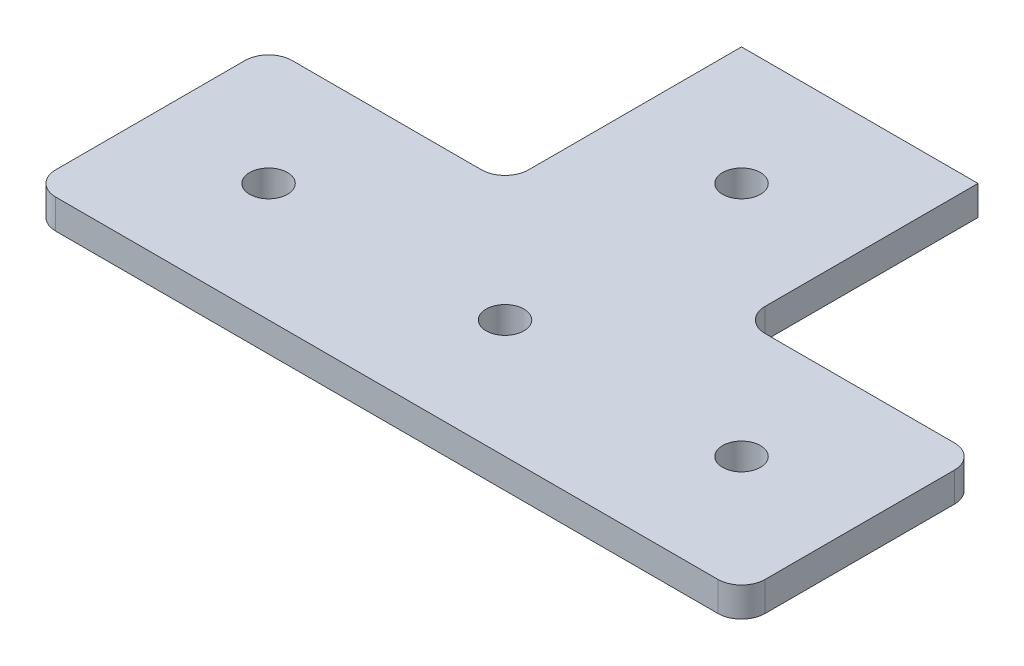
ISO-10303-21;
HEADER;
FILE_DESCRIPTION(('STEP AP214'),'2;1');
FILE_NAME('part.step','',(''),(''),'','','');
FILE_SCHEMA(('AUTOMOTIVE_DESIGN { 1 0 10303 214 1 1 1 1 }'));
ENDSEC;
DATA;
#1=APPLICATION_CONTEXT('core data for automotive mechanical design processes');
#2=APPLICATION_PROTOCOL_DEFINITION('international standard','automotive_design',2000,#1);
#3=PRODUCT_CONTEXT('',#1,'mechanical');
#4=PRODUCT('Part','Part','',(#3));
#5=PRODUCT_RELATED_PRODUCT_CATEGORY('part','',(#4));
#6=PRODUCT_DEFINITION_FORMATION('','',#4);
#7=PRODUCT_DEFINITION_CONTEXT('part definition',#1,'design');
#8=PRODUCT_DEFINITION('design','',#6,#7);
#9=PRODUCT_DEFINITION_SHAPE('','',#8);
#10=(LENGTH_UNIT() NAMED_UNIT(*) SI_UNIT(.MILLI.,.METRE.));
#11=(NAMED_UNIT(*) PLANE_ANGLE_UNIT() SI_UNIT($,.RADIAN.));
#12=(NAMED_UNIT(*) SI_UNIT($,.STERADIAN.) SOLID_ANGLE_UNIT());
#13=UNCERTAINTY_MEASURE_WITH_UNIT(LENGTH_MEASURE(1.E-05),#10,'distance_accuracy_value','');
#14=(GEOMETRIC_REPRESENTATION_CONTEXT(3) GLOBAL_UNCERTAINTY_ASSIGNED_CONTEXT((#13)) GLOBAL_UNIT_ASSIGNED_CONTEXT((#10,
#11,#12)) REPRESENTATION_CONTEXT('',''));
#15=CARTESIAN_POINT('',(0.,0.,0.));
#16=DIRECTION('',(0.,0.,1.));
#17=DIRECTION('',(1.,0.,0.));
#18=AXIS2_PLACEMENT_3D('',#15,#16,#17);
#19=CARTESIAN_POINT('',(-11.7594560669456,3.175,-20.0357112970711));
#20=DIRECTION('',(0.,1.,0.));
#21=DIRECTION('',(0.,0.,1.));
#22=AXIS2_PLACEMENT_3D('',#19,#20,#21);
#23=PLANE('',#22);
#24=CARTESIAN_POINT('',(28.8805439330544,3.175,-4.79571129707114));
#25=DIRECTION('',(0.,1.,0.));
#26=DIRECTION('',(0.,0.,1.));
#27=AXIS2_PLACEMENT_3D('',#24,#25,#26);
#28=CIRCLE('',#27,2.032);
#29=CARTESIAN_POINT('',(28.8805439330544,3.175,-2.76371129707114));
#30=VERTEX_POINT('',#29);
#31=EDGE_CURVE('E318',#30,#30,#28,.T.);
#32=ORIENTED_EDGE('',*,*,#31,.F.);
#33=EDGE_LOOP('',(#32));
#34=FACE_BOUND('',#33,.T.);
#35=CARTESIAN_POINT('',(3.48054393305439,3.175,-4.79571129707114));
#36=DIRECTION('',(0.,1.,0.));
#37=DIRECTION('',(0.,0.,1.));
#38=AXIS2_PLACEMENT_3D('',#35,#36,#37);
#39=CIRCLE('',#38,2.032);
#40=CARTESIAN_POINT('',(3.48054393305439,3.175,-2.76371129707114));
#41=VERTEX_POINT('',#40);
#42=EDGE_CURVE('E171',#41,#41,#39,.T.);
#43=ORIENTED_EDGE('',*,*,#42,.F.);
#44=EDGE_LOOP('',(#43));
#45=FACE_BOUND('',#44,.T.);
#46=CARTESIAN_POINT('',(-11.7594560669456,3.175,-20.0357112970711));
#47=DIRECTION('',(0.,-1.,0.));
#48=DIRECTION('',(0.,0.,1.));
#49=AXIS2_PLACEMENT_3D('',#46,#47,#48);
#50=CIRCLE('',#49,2.54);
#51=CARTESIAN_POINT('',(-9.21945606694562,3.175,-20.0357112970712));
#52=VERTEX_POINT('',#51);
#53=CARTESIAN_POINT('',(-11.7594560669456,3.175,-17.4957112970711));
#54=VERTEX_POINT('',#53);
#55=EDGE_CURVE('E194',#52,#54,#50,.T.);
#56=ORIENTED_EDGE('',*,*,#55,.T.);
#57=DIRECTION('',(-1.,0.,0.));
#58=VECTOR('',#57,1.);
#59=CARTESIAN_POINT('',(-32.0794560669456,3.175,-17.4957112970711));
#60=LINE('',#59,#58);
#61=CARTESIAN_POINT('',(-32.0794560669456,3.175,-17.4957112970711));
#62=VERTEX_POINT('',#61);
#63=EDGE_CURVE('E112',#54,#62,#60,.T.);
#64=ORIENTED_EDGE('',*,*,#63,.T.);
#65=CARTESIAN_POINT('',(-32.0794560669456,3.175,-14.9557112970711));
#66=DIRECTION('',(0.,1.,0.));
#67=DIRECTION('',(0.,0.,-1.));
#68=AXIS2_PLACEMENT_3D('',#65,#66,#67);
#69=CIRCLE('',#68,2.54);
#70=CARTESIAN_POINT('',(-34.6194560669456,3.175,-14.9557112970711));
#71=VERTEX_POINT('',#70);
#72=EDGE_CURVE('E227',#62,#71,#69,.T.);
#73=ORIENTED_EDGE('',*,*,#72,.T.);
#74=DIRECTION('',(0.,0.,1.));
#75=VECTOR('',#74,1.);
#76=CARTESIAN_POINT('',(-34.6194560669456,3.175,-14.9557112970711));
#77=LINE('',#76,#75);
#78=CARTESIAN_POINT('',(-34.6194560669456,3.175,5.36428870292885));
#79=VERTEX_POINT('',#78);
#80=EDGE_CURVE('E246',#71,#79,#77,.T.);
#81=ORIENTED_EDGE('',*,*,#80,.T.);
#82=CARTESIAN_POINT('',(-32.0794560669456,3.175,5.36428870292887));
#83=DIRECTION('',(0.,1.,0.));
#84=DIRECTION('',(0.,0.,-1.));
#85=AXIS2_PLACEMENT_3D('',#82,#83,#84);
#86=CIRCLE('',#85,2.54);
#87=CARTESIAN_POINT('',(-32.0794560669456,3.175,7.90428870292886));
#88=VERTEX_POINT('',#87);
#89=EDGE_CURVE('E243',#79,#88,#86,.T.);
#90=ORIENTED_EDGE('',*,*,#89,.T.);
#91=DIRECTION('',(1.,0.,0.));
#92=VECTOR('',#91,1.);
#93=CARTESIAN_POINT('',(-32.0794560669456,3.175,7.90428870292886));
#94=LINE('',#93,#92);
#95=CARTESIAN_POINT('',(39.0405439330544,3.175,7.90428870292886));
#96=VERTEX_POINT('',#95);
#97=EDGE_CURVE('E245',#88,#96,#94,.T.);
#98=ORIENTED_EDGE('',*,*,#97,.T.);
#99=CARTESIAN_POINT('',(39.0405439330544,3.175,5.36428870292886));
#100=DIRECTION('',(0.,1.,0.));
#101=DIRECTION('',(0.,0.,-1.));
#102=AXIS2_PLACEMENT_3D('',#99,#100,#101);
#103=CIRCLE('',#102,2.54);
#104=CARTESIAN_POINT('',(41.5805439330544,3.175,5.36428870292885));
#105=VERTEX_POINT('',#104);
#106=EDGE_CURVE('E248',#96,#105,#103,.T.);
#107=ORIENTED_EDGE('',*,*,#106,.T.);
#108=DIRECTION('',(0.,0.,-1.));
#109=VECTOR('',#108,1.);
#110=CARTESIAN_POINT('',(41.5805439330544,3.175,-14.9557112970711));
#111=LINE('',#110,#109);
#112=CARTESIAN_POINT('',(41.5805439330544,3.175,-14.9557112970711));
#113=VERTEX_POINT('',#112);
#114=EDGE_CURVE('E254',#105,#113,#111,.T.);
#115=ORIENTED_EDGE('',*,*,#114,.T.);
#116=CARTESIAN_POINT('',(39.0405439330544,3.175,-14.9557112970711));
#117=DIRECTION('',(0.,1.,0.));
#118=DIRECTION('',(0.,0.,-1.));
#119=AXIS2_PLACEMENT_3D('',#116,#117,#118);
#120=CIRCLE('',#119,2.54);
#121=CARTESIAN_POINT('',(39.0405439330544,3.175,-17.4957112970711));
#122=VERTEX_POINT('',#121);
#123=EDGE_CURVE('E256',#113,#122,#120,.T.);
#124=ORIENTED_EDGE('',*,*,#123,.T.);
#125=DIRECTION('',(-1.,0.,0.));
#126=VECTOR('',#125,1.);
#127=CARTESIAN_POINT('',(18.7205439330544,3.175,-17.4957112970711));
#128=LINE('',#127,#126);
#129=CARTESIAN_POINT('',(18.7205439330544,3.175,-17.4957112970711));
#130=VERTEX_POINT('',#129);
#131=EDGE_CURVE('E258',#122,#130,#128,.T.);
#132=ORIENTED_EDGE('',*,*,#131,.T.);
#133=CARTESIAN_POINT('',(18.7205439330544,3.175,-20.0357112970711));
#134=DIRECTION('',(0.,-1.,0.));
#135=DIRECTION('',(0.,0.,1.));
#136=AXIS2_PLACEMENT_3D('',#133,#134,#135);
#137=CIRCLE('',#136,2.54);
#138=CARTESIAN_POINT('',(16.1805439330544,3.175,-20.0357112970712));
#139=VERTEX_POINT('',#138);
#140=EDGE_CURVE('E149',#130,#139,#137,.T.);
#141=ORIENTED_EDGE('',*,*,#140,.T.);
#142=DIRECTION('',(0.,0.,-1.));
#143=VECTOR('',#142,1.);
#144=CARTESIAN_POINT('',(16.1805439330544,3.175,-20.0357112970712));
#145=LINE('',#144,#143);
#146=CARTESIAN_POINT('',(16.1805439330544,3.175,-42.8957112970711));
#147=VERTEX_POINT('',#146);
#148=EDGE_CURVE('E143',#139,#147,#145,.T.);
#149=ORIENTED_EDGE('',*,*,#148,.T.);
#150=DIRECTION('',(-1.,0.,0.));
#151=VECTOR('',#150,1.);
#152=CARTESIAN_POINT('',(-9.21945606694562,3.175,-42.8957112970711));
#153=LINE('',#152,#151);
#154=CARTESIAN_POINT('',(-9.21945606694562,3.175,-42.8957112970711));
#155=VERTEX_POINT('',#154);
#156=EDGE_CURVE('E147',#147,#155,#153,.T.);
#157=ORIENTED_EDGE('',*,*,#156,.T.);
#158=DIRECTION('',(0.,0.,1.));
#159=VECTOR('',#158,1.);
#160=CARTESIAN_POINT('',(-9.21945606694562,3.175,-20.0357112970712));
#161=LINE('',#160,#159);
#162=EDGE_CURVE('E51',#155,#52,#161,.T.);
#163=ORIENTED_EDGE('',*,*,#162,.T.);
#164=EDGE_LOOP('',(#56,#64,#73,#81,#90,#98,#107,#115,#124,#132,#141,#149,#157,#163));
#165=FACE_BOUND('',#164,.T.);
#166=CARTESIAN_POINT('',(-21.9194560669456,3.175,-4.79571129707114));
#167=DIRECTION('',(0.,1.,0.));
#168=DIRECTION('',(0.,0.,1.));
#169=AXIS2_PLACEMENT_3D('',#166,#167,#168);
#170=CIRCLE('',#169,2.032);
#171=CARTESIAN_POINT('',(-21.9194560669456,3.175,-2.76371129707114));
#172=VERTEX_POINT('',#171);
#173=EDGE_CURVE('E324',#172,#172,#170,.T.);
#174=ORIENTED_EDGE('',*,*,#173,.F.);
#175=EDGE_LOOP('',(#174));
#176=FACE_BOUND('',#175,.T.);
#177=CARTESIAN_POINT('',(3.48054393305439,3.175,-30.1957112970711));
#178=DIRECTION('',(0.,1.,0.));
#179=DIRECTION('',(0.,0.,1.));
#180=AXIS2_PLACEMENT_3D('',#177,#178,#179);
#181=CIRCLE('',#180,2.032);
#182=CARTESIAN_POINT('',(3.48054393305439,3.175,-28.1637112970711));
#183=VERTEX_POINT('',#182);
#184=EDGE_CURVE('E309',#183,#183,#181,.T.);
#185=ORIENTED_EDGE('',*,*,#184,.F.);
#186=EDGE_LOOP('',(#185));
#187=FACE_BOUND('',#186,.T.);
#188=ADVANCED_FACE('F34',(#34,#45,#165,#176,#187),#23,.T.);
#189=CARTESIAN_POINT('',(-11.7594560669456,0.,-20.0357112970711));
#190=DIRECTION('',(0.,1.,0.));
#191=DIRECTION('',(0.,0.,1.));
#192=AXIS2_PLACEMENT_3D('',#189,#190,#191);
#193=PLANE('',#192);
#194=CARTESIAN_POINT('',(-11.7594560669456,0.,-20.0357112970711));
#195=DIRECTION('',(0.,-1.,0.));
#196=DIRECTION('',(0.,0.,1.));
#197=AXIS2_PLACEMENT_3D('',#194,#195,#196);
#198=CIRCLE('',#197,2.54);
#199=CARTESIAN_POINT('',(-9.21945606694562,0.,-20.0357112970712));
#200=VERTEX_POINT('',#199);
#201=CARTESIAN_POINT('',(-11.7594560669456,0.,-17.4957112970711));
#202=VERTEX_POINT('',#201);
#203=EDGE_CURVE('E167',#200,#202,#198,.T.);
#204=ORIENTED_EDGE('',*,*,#203,.F.);
#205=DIRECTION('',(0.,0.,1.));
#206=VECTOR('',#205,1.);
#207=CARTESIAN_POINT('',(-9.21945606694562,0.,-20.0357112970712));
#208=LINE('',#207,#206);
#209=CARTESIAN_POINT('',(-9.21945606694562,0.,-42.8957112970711));
#210=VERTEX_POINT('',#209);
#211=EDGE_CURVE('E104',#210,#200,#208,.T.);
#212=ORIENTED_EDGE('',*,*,#211,.F.);
#213=DIRECTION('',(-1.,0.,0.));
#214=VECTOR('',#213,1.);
#215=CARTESIAN_POINT('',(-9.21945606694562,0.,-42.8957112970711));
#216=LINE('',#215,#214);
#217=CARTESIAN_POINT('',(16.1805439330544,0.,-42.8957112970711));
#218=VERTEX_POINT('',#217);
#219=EDGE_CURVE('E98',#218,#210,#216,.T.);
#220=ORIENTED_EDGE('',*,*,#219,.F.);
#221=DIRECTION('',(0.,0.,-1.));
#222=VECTOR('',#221,1.);
#223=CARTESIAN_POINT('',(16.1805439330544,0.,-20.0357112970712));
#224=LINE('',#223,#222);
#225=CARTESIAN_POINT('',(16.1805439330544,0.,-20.0357112970712));
#226=VERTEX_POINT('',#225);
#227=EDGE_CURVE('E157',#226,#218,#224,.T.);
#228=ORIENTED_EDGE('',*,*,#227,.F.);
#229=CARTESIAN_POINT('',(18.7205439330544,0.,-20.0357112970711));
#230=DIRECTION('',(0.,-1.,0.));
#231=DIRECTION('',(0.,0.,1.));
#232=AXIS2_PLACEMENT_3D('',#229,#230,#231);
#233=CIRCLE('',#232,2.54);
#234=CARTESIAN_POINT('',(18.7205439330544,0.,-17.4957112970711));
#235=VERTEX_POINT('',#234);
#236=EDGE_CURVE('E189',#235,#226,#233,.T.);
#237=ORIENTED_EDGE('',*,*,#236,.F.);
#238=DIRECTION('',(-1.,0.,0.));
#239=VECTOR('',#238,1.);
#240=CARTESIAN_POINT('',(18.7205439330544,0.,-17.4957112970711));
#241=LINE('',#240,#239);
#242=CARTESIAN_POINT('',(39.0405439330544,0.,-17.4957112970711));
#243=VERTEX_POINT('',#242);
#244=EDGE_CURVE('E187',#243,#235,#241,.T.);
#245=ORIENTED_EDGE('',*,*,#244,.F.);
#246=CARTESIAN_POINT('',(39.0405439330544,0.,-14.9557112970711));
#247=DIRECTION('',(0.,1.,0.));
#248=DIRECTION('',(0.,0.,-1.));
#249=AXIS2_PLACEMENT_3D('',#246,#247,#248);
#250=CIRCLE('',#249,2.54);
#251=CARTESIAN_POINT('',(41.5805439330544,0.,-14.9557112970711));
#252=VERTEX_POINT('',#251);
#253=EDGE_CURVE('E185',#252,#243,#250,.T.);
#254=ORIENTED_EDGE('',*,*,#253,.F.);
#255=DIRECTION('',(0.,0.,-1.));
#256=VECTOR('',#255,1.);
#257=CARTESIAN_POINT('',(41.5805439330544,0.,-14.9557112970711));
#258=LINE('',#257,#256);
#259=CARTESIAN_POINT('',(41.5805439330544,0.,5.36428870292885));
#260=VERTEX_POINT('',#259);
#261=EDGE_CURVE('E183',#260,#252,#258,.T.);
#262=ORIENTED_EDGE('',*,*,#261,.F.);
#263=CARTESIAN_POINT('',(39.0405439330544,0.,5.36428870292886));
#264=DIRECTION('',(0.,1.,0.));
#265=DIRECTION('',(0.,0.,-1.));
#266=AXIS2_PLACEMENT_3D('',#263,#264,#265);
#267=CIRCLE('',#266,2.54);
#268=CARTESIAN_POINT('',(39.0405439330544,0.,7.90428870292886));
#269=VERTEX_POINT('',#268);
#270=EDGE_CURVE('E181',#269,#260,#267,.T.);
#271=ORIENTED_EDGE('',*,*,#270,.F.);
#272=DIRECTION('',(1.,0.,0.));
#273=VECTOR('',#272,1.);
#274=CARTESIAN_POINT('',(-32.0794560669456,0.,7.90428870292886));
#275=LINE('',#274,#273);
#276=CARTESIAN_POINT('',(-32.0794560669456,0.,7.90428870292886));
#277=VERTEX_POINT('',#276);
#278=EDGE_CURVE('E179',#277,#269,#275,.T.);
#279=ORIENTED_EDGE('',*,*,#278,.F.);
#280=CARTESIAN_POINT('',(-32.0794560669456,0.,5.36428870292887));
#281=DIRECTION('',(0.,1.,0.));
#282=DIRECTION('',(0.,0.,-1.));
#283=AXIS2_PLACEMENT_3D('',#280,#281,#282);
#284=CIRCLE('',#283,2.54);
#285=CARTESIAN_POINT('',(-34.6194560669456,0.,5.36428870292885));
#286=VERTEX_POINT('',#285);
#287=EDGE_CURVE('E177',#286,#277,#284,.T.);
#288=ORIENTED_EDGE('',*,*,#287,.F.);
#289=DIRECTION('',(0.,0.,1.));
#290=VECTOR('',#289,1.);
#291=CARTESIAN_POINT('',(-34.6194560669456,0.,-14.9557112970711));
#292=LINE('',#291,#290);
#293=CARTESIAN_POINT('',(-34.6194560669456,0.,-14.9557112970711));
#294=VERTEX_POINT('',#293);
#295=EDGE_CURVE('E175',#294,#286,#292,.T.);
#296=ORIENTED_EDGE('',*,*,#295,.F.);
#297=CARTESIAN_POINT('',(-32.0794560669456,0.,-14.9557112970711));
#298=DIRECTION('',(0.,1.,0.));
#299=DIRECTION('',(0.,0.,-1.));
#300=AXIS2_PLACEMENT_3D('',#297,#298,#299);
#301=CIRCLE('',#300,2.54);
#302=CARTESIAN_POINT('',(-32.0794560669456,0.,-17.4957112970711));
#303=VERTEX_POINT('',#302);
#304=EDGE_CURVE('E173',#303,#294,#301,.T.);
#305=ORIENTED_EDGE('',*,*,#304,.F.);
#306=DIRECTION('',(-1.,0.,0.));
#307=VECTOR('',#306,1.);
#308=CARTESIAN_POINT('',(-32.0794560669456,0.,-17.4957112970711));
#309=LINE('',#308,#307);
#310=EDGE_CURVE('E170',#202,#303,#309,.T.);
#311=ORIENTED_EDGE('',*,*,#310,.F.);
#312=EDGE_LOOP('',(#204,#212,#220,#228,#237,#245,#254,#262,#271,#279,#288,#296,#305,#311));
#313=FACE_BOUND('',#312,.T.);
#314=CARTESIAN_POINT('',(3.48054393305439,0.,-4.79571129707114));
#315=DIRECTION('',(0.,1.,0.));
#316=DIRECTION('',(0.,0.,1.));
#317=AXIS2_PLACEMENT_3D('',#314,#315,#316);
#318=CIRCLE('',#317,2.032);
#319=CARTESIAN_POINT('',(3.48054393305439,0.,-2.76371129707114));
#320=VERTEX_POINT('',#319);
#321=EDGE_CURVE('E327',#320,#320,#318,.T.);
#322=ORIENTED_EDGE('',*,*,#321,.T.);
#323=EDGE_LOOP('',(#322));
#324=FACE_BOUND('',#323,.T.);
#325=CARTESIAN_POINT('',(-21.9194560669456,0.,-4.79571129707114));
#326=DIRECTION('',(0.,1.,0.));
#327=DIRECTION('',(0.,0.,1.));
#328=AXIS2_PLACEMENT_3D('',#325,#326,#327);
#329=CIRCLE('',#328,2.032);
#330=CARTESIAN_POINT('',(-21.9194560669456,0.,-2.76371129707114));
#331=VERTEX_POINT('',#330);
#332=EDGE_CURVE('E321',#331,#331,#329,.T.);
#333=ORIENTED_EDGE('',*,*,#332,.T.);
#334=EDGE_LOOP('',(#333));
#335=FACE_BOUND('',#334,.T.);
#336=CARTESIAN_POINT('',(28.8805439330544,0.,-4.79571129707114));
#337=DIRECTION('',(0.,1.,0.));
#338=DIRECTION('',(0.,0.,1.));
#339=AXIS2_PLACEMENT_3D('',#336,#337,#338);
#340=CIRCLE('',#339,2.032);
#341=CARTESIAN_POINT('',(28.8805439330544,0.,-2.76371129707114));
#342=VERTEX_POINT('',#341);
#343=EDGE_CURVE('E315',#342,#342,#340,.T.);
#344=ORIENTED_EDGE('',*,*,#343,.T.);
#345=EDGE_LOOP('',(#344));
#346=FACE_BOUND('',#345,.T.);
#347=CARTESIAN_POINT('',(3.48054393305439,0.,-30.1957112970711));
#348=DIRECTION('',(0.,1.,0.));
#349=DIRECTION('',(0.,0.,1.));
#350=AXIS2_PLACEMENT_3D('',#347,#348,#349);
#351=CIRCLE('',#350,2.032);
#352=CARTESIAN_POINT('',(3.48054393305439,0.,-28.1637112970711));
#353=VERTEX_POINT('',#352);
#354=EDGE_CURVE('E312',#353,#353,#351,.T.);
#355=ORIENTED_EDGE('',*,*,#354,.T.);
#356=EDGE_LOOP('',(#355));
#357=FACE_BOUND('',#356,.T.);
#358=ADVANCED_FACE('F231',(#313,#324,#335,#346,#357),#193,.F.);
#359=CARTESIAN_POINT('',(-11.7594560669456,3.175,-20.0357112970711));
#360=DIRECTION('',(0.,-1.,0.));
#361=DIRECTION('',(0.,0.,-1.));
#362=AXIS2_PLACEMENT_3D('',#359,#360,#361);
#363=CYLINDRICAL_SURFACE('',#362,2.54);
#364=ORIENTED_EDGE('',*,*,#203,.T.);
#365=DIRECTION('',(0.,-1.,0.));
#366=VECTOR('',#365,1.);
#367=CARTESIAN_POINT('',(-11.7594560669456,3.175,-17.4957112970711));
#368=LINE('',#367,#366);
#369=EDGE_CURVE('E11',#54,#202,#368,.T.);
#370=ORIENTED_EDGE('',*,*,#369,.F.);
#371=ORIENTED_EDGE('',*,*,#55,.F.);
#372=DIRECTION('',(0.,-1.,0.));
#373=VECTOR('',#372,1.);
#374=CARTESIAN_POINT('',(-9.21945606694562,3.175,-20.0357112970712));
#375=LINE('',#374,#373);
#376=EDGE_CURVE('E163',#52,#200,#375,.T.);
#377=ORIENTED_EDGE('',*,*,#376,.T.);
#378=EDGE_LOOP('',(#364,#370,#371,#377));
#379=FACE_BOUND('',#378,.T.);
#380=ADVANCED_FACE('F36',(#379),#363,.F.);
#381=CARTESIAN_POINT('',(-32.0794560669456,3.175,-17.4957112970711));
#382=DIRECTION('',(0.,0.,1.));
#383=DIRECTION('',(1.,0.,0.));
#384=AXIS2_PLACEMENT_3D('',#381,#382,#383);
#385=PLANE('',#384);
#386=ORIENTED_EDGE('',*,*,#310,.T.);
#387=DIRECTION('',(0.,-1.,0.));
#388=VECTOR('',#387,1.);
#389=CARTESIAN_POINT('',(-32.0794560669456,3.175,-17.4957112970711));
#390=LINE('',#389,#388);
#391=EDGE_CURVE('E43',#62,#303,#390,.T.);
#392=ORIENTED_EDGE('',*,*,#391,.F.);
#393=ORIENTED_EDGE('',*,*,#63,.F.);
#394=ORIENTED_EDGE('',*,*,#369,.T.);
#395=EDGE_LOOP('',(#386,#392,#393,#394));
#396=FACE_BOUND('',#395,.T.);
#397=ADVANCED_FACE('F457',(#396),#385,.F.);
#398=CARTESIAN_POINT('',(-32.0794560669456,3.175,-14.9557112970711));
#399=DIRECTION('',(0.,-1.,0.));
#400=DIRECTION('',(0.,0.,-1.));
#401=AXIS2_PLACEMENT_3D('',#398,#399,#400);
#402=CYLINDRICAL_SURFACE('',#401,2.54);
#403=ORIENTED_EDGE('',*,*,#304,.T.);
#404=DIRECTION('',(0.,-1.,0.));
#405=VECTOR('',#404,1.);
#406=CARTESIAN_POINT('',(-34.6194560669456,3.175,-14.9557112970711));
#407=LINE('',#406,#405);
#408=EDGE_CURVE('E219',#71,#294,#407,.T.);
#409=ORIENTED_EDGE('',*,*,#408,.F.);
#410=ORIENTED_EDGE('',*,*,#72,.F.);
#411=ORIENTED_EDGE('',*,*,#391,.T.);
#412=EDGE_LOOP('',(#403,#409,#410,#411));
#413=FACE_BOUND('',#412,.T.);
#414=ADVANCED_FACE('F225',(#413),#402,.T.);
#415=CARTESIAN_POINT('',(-34.6194560669456,3.175,-14.9557112970711));
#416=DIRECTION('',(1.,0.,0.));
#417=DIRECTION('',(0.,0.,-1.));
#418=AXIS2_PLACEMENT_3D('',#415,#416,#417);
#419=PLANE('',#418);
#420=ORIENTED_EDGE('',*,*,#295,.T.);
#421=DIRECTION('',(0.,-1.,0.));
#422=VECTOR('',#421,1.);
#423=CARTESIAN_POINT('',(-34.6194560669456,3.175,5.36428870292885));
#424=LINE('',#423,#422);
#425=EDGE_CURVE('E216',#79,#286,#424,.T.);
#426=ORIENTED_EDGE('',*,*,#425,.F.);
#427=ORIENTED_EDGE('',*,*,#80,.F.);
#428=ORIENTED_EDGE('',*,*,#408,.T.);
#429=EDGE_LOOP('',(#420,#426,#427,#428));
#430=FACE_BOUND('',#429,.T.);
#431=ADVANCED_FACE('F237',(#430),#419,.F.);
#432=CARTESIAN_POINT('',(-32.0794560669456,3.175,5.36428870292887));
#433=DIRECTION('',(0.,-1.,0.));
#434=DIRECTION('',(0.,0.,-1.));
#435=AXIS2_PLACEMENT_3D('',#432,#433,#434);
#436=CYLINDRICAL_SURFACE('',#435,2.54);
#437=ORIENTED_EDGE('',*,*,#287,.T.);
#438=DIRECTION('',(0.,-1.,0.));
#439=VECTOR('',#438,1.);
#440=CARTESIAN_POINT('',(-32.0794560669456,3.175,7.90428870292886));
#441=LINE('',#440,#439);
#442=EDGE_CURVE('E213',#88,#277,#441,.T.);
#443=ORIENTED_EDGE('',*,*,#442,.F.);
#444=ORIENTED_EDGE('',*,*,#89,.F.);
#445=ORIENTED_EDGE('',*,*,#425,.T.);
#446=EDGE_LOOP('',(#437,#443,#444,#445));
#447=FACE_BOUND('',#446,.T.);
#448=ADVANCED_FACE('F241',(#447),#436,.T.);
#449=CARTESIAN_POINT('',(-32.0794560669456,3.175,7.90428870292886));
#450=DIRECTION('',(0.,0.,-1.));
#451=DIRECTION('',(-1.,0.,0.));
#452=AXIS2_PLACEMENT_3D('',#449,#450,#451);
#453=PLANE('',#452);
#454=ORIENTED_EDGE('',*,*,#278,.T.);
#455=DIRECTION('',(0.,-1.,0.));
#456=VECTOR('',#455,1.);
#457=CARTESIAN_POINT('',(39.0405439330544,3.175,7.90428870292886));
#458=LINE('',#457,#456);
#459=EDGE_CURVE('E210',#96,#269,#458,.T.);
#460=ORIENTED_EDGE('',*,*,#459,.F.);
#461=ORIENTED_EDGE('',*,*,#97,.F.);
#462=ORIENTED_EDGE('',*,*,#442,.T.);
#463=EDGE_LOOP('',(#454,#460,#461,#462));
#464=FACE_BOUND('',#463,.T.);
#465=ADVANCED_FACE('F422',(#464),#453,.F.);
#466=CARTESIAN_POINT('',(39.0405439330544,3.175,5.36428870292886));
#467=DIRECTION('',(0.,-1.,0.));
#468=DIRECTION('',(0.,0.,-1.));
#469=AXIS2_PLACEMENT_3D('',#466,#467,#468);
#470=CYLINDRICAL_SURFACE('',#469,2.54);
#471=ORIENTED_EDGE('',*,*,#270,.T.);
#472=DIRECTION('',(0.,-1.,0.));
#473=VECTOR('',#472,1.);
#474=CARTESIAN_POINT('',(41.5805439330544,3.175,5.36428870292885));
#475=LINE('',#474,#473);
#476=EDGE_CURVE('E207',#105,#260,#475,.T.);
#477=ORIENTED_EDGE('',*,*,#476,.F.);
#478=ORIENTED_EDGE('',*,*,#106,.F.);
#479=ORIENTED_EDGE('',*,*,#459,.T.);
#480=EDGE_LOOP('',(#471,#477,#478,#479));
#481=FACE_BOUND('',#480,.T.);
#482=ADVANCED_FACE('F412',(#481),#470,.T.);
#483=CARTESIAN_POINT('',(41.5805439330544,3.175,-14.9557112970711));
#484=DIRECTION('',(-1.,0.,0.));
#485=DIRECTION('',(0.,0.,1.));
#486=AXIS2_PLACEMENT_3D('',#483,#484,#485);
#487=PLANE('',#486);
#488=ORIENTED_EDGE('',*,*,#261,.T.);
#489=DIRECTION('',(0.,-1.,0.));
#490=VECTOR('',#489,1.);
#491=CARTESIAN_POINT('',(41.5805439330544,3.175,-14.9557112970711));
#492=LINE('',#491,#490);
#493=EDGE_CURVE('E204',#113,#252,#492,.T.);
#494=ORIENTED_EDGE('',*,*,#493,.F.);
#495=ORIENTED_EDGE('',*,*,#114,.F.);
#496=ORIENTED_EDGE('',*,*,#476,.T.);
#497=EDGE_LOOP('',(#488,#494,#495,#496));
#498=FACE_BOUND('',#497,.T.);
#499=ADVANCED_FACE('F402',(#498),#487,.F.);
#500=CARTESIAN_POINT('',(39.0405439330544,3.175,-14.9557112970711));
#501=DIRECTION('',(0.,-1.,0.));
#502=DIRECTION('',(0.,0.,-1.));
#503=AXIS2_PLACEMENT_3D('',#500,#501,#502);
#504=CYLINDRICAL_SURFACE('',#503,2.54);
#505=ORIENTED_EDGE('',*,*,#253,.T.);
#506=DIRECTION('',(0.,-1.,0.));
#507=VECTOR('',#506,1.);
#508=CARTESIAN_POINT('',(39.0405439330544,3.175,-17.4957112970711));
#509=LINE('',#508,#507);
#510=EDGE_CURVE('E201',#122,#243,#509,.T.);
#511=ORIENTED_EDGE('',*,*,#510,.F.);
#512=ORIENTED_EDGE('',*,*,#123,.F.);
#513=ORIENTED_EDGE('',*,*,#493,.T.);
#514=EDGE_LOOP('',(#505,#511,#512,#513));
#515=FACE_BOUND('',#514,.T.);
#516=ADVANCED_FACE('F393',(#515),#504,.T.);
#517=CARTESIAN_POINT('',(18.7205439330544,3.175,-17.4957112970711));
#518=DIRECTION('',(0.,0.,1.));
#519=DIRECTION('',(1.,0.,0.));
#520=AXIS2_PLACEMENT_3D('',#517,#518,#519);
#521=PLANE('',#520);
#522=ORIENTED_EDGE('',*,*,#244,.T.);
#523=DIRECTION('',(0.,-1.,0.));
#524=VECTOR('',#523,1.);
#525=CARTESIAN_POINT('',(18.7205439330544,3.175,-17.4957112970711));
#526=LINE('',#525,#524);
#527=EDGE_CURVE('E198',#130,#235,#526,.T.);
#528=ORIENTED_EDGE('',*,*,#527,.F.);
#529=ORIENTED_EDGE('',*,*,#131,.F.);
#530=ORIENTED_EDGE('',*,*,#510,.T.);
#531=EDGE_LOOP('',(#522,#528,#529,#530));
#532=FACE_BOUND('',#531,.T.);
#533=ADVANCED_FACE('F264',(#532),#521,.F.);
#534=CARTESIAN_POINT('',(18.7205439330544,3.175,-20.0357112970711));
#535=DIRECTION('',(0.,-1.,0.));
#536=DIRECTION('',(0.,0.,-1.));
#537=AXIS2_PLACEMENT_3D('',#534,#535,#536);
#538=CYLINDRICAL_SURFACE('',#537,2.54);
#539=ORIENTED_EDGE('',*,*,#236,.T.);
#540=DIRECTION('',(0.,-1.,0.));
#541=VECTOR('',#540,1.);
#542=CARTESIAN_POINT('',(16.1805439330544,3.175,-20.0357112970712));
#543=LINE('',#542,#541);
#544=EDGE_CURVE('E158',#139,#226,#543,.T.);
#545=ORIENTED_EDGE('',*,*,#544,.F.);
#546=ORIENTED_EDGE('',*,*,#140,.F.);
#547=ORIENTED_EDGE('',*,*,#527,.T.);
#548=EDGE_LOOP('',(#539,#545,#546,#547));
#549=FACE_BOUND('',#548,.T.);
#550=ADVANCED_FACE('F268',(#549),#538,.F.);
#551=CARTESIAN_POINT('',(16.1805439330544,3.175,-20.0357112970712));
#552=DIRECTION('',(-1.,0.,0.));
#553=DIRECTION('',(0.,0.,1.));
#554=AXIS2_PLACEMENT_3D('',#551,#552,#553);
#555=PLANE('',#554);
#556=ORIENTED_EDGE('',*,*,#227,.T.);
#557=DIRECTION('',(0.,-1.,0.));
#558=VECTOR('',#557,1.);
#559=CARTESIAN_POINT('',(16.1805439330544,3.175,-42.8957112970711));
#560=LINE('',#559,#558);
#561=EDGE_CURVE('E154',#147,#218,#560,.T.);
#562=ORIENTED_EDGE('',*,*,#561,.F.);
#563=ORIENTED_EDGE('',*,*,#148,.F.);
#564=ORIENTED_EDGE('',*,*,#544,.T.);
#565=EDGE_LOOP('',(#556,#562,#563,#564));
#566=FACE_BOUND('',#565,.T.);
#567=ADVANCED_FACE('F155',(#566),#555,.F.);
#568=CARTESIAN_POINT('',(-9.21945606694562,3.175,-42.8957112970711));
#569=DIRECTION('',(0.,0.,1.));
#570=DIRECTION('',(1.,0.,0.));
#571=AXIS2_PLACEMENT_3D('',#568,#569,#570);
#572=PLANE('',#571);
#573=ORIENTED_EDGE('',*,*,#219,.T.);
#574=DIRECTION('',(0.,-1.,0.));
#575=VECTOR('',#574,1.);
#576=CARTESIAN_POINT('',(-9.21945606694562,3.175,-42.8957112970711));
#577=LINE('',#576,#575);
#578=EDGE_CURVE('E159',#155,#210,#577,.T.);
#579=ORIENTED_EDGE('',*,*,#578,.F.);
#580=ORIENTED_EDGE('',*,*,#156,.F.);
#581=ORIENTED_EDGE('',*,*,#561,.T.);
#582=EDGE_LOOP('',(#573,#579,#580,#581));
#583=FACE_BOUND('',#582,.T.);
#584=ADVANCED_FACE('F161',(#583),#572,.F.);
#585=CARTESIAN_POINT('',(-9.21945606694562,3.175,-20.0357112970712));
#586=DIRECTION('',(1.,0.,0.));
#587=DIRECTION('',(0.,0.,-1.));
#588=AXIS2_PLACEMENT_3D('',#585,#586,#587);
#589=PLANE('',#588);
#590=ORIENTED_EDGE('',*,*,#211,.T.);
#591=ORIENTED_EDGE('',*,*,#376,.F.);
#592=ORIENTED_EDGE('',*,*,#162,.F.);
#593=ORIENTED_EDGE('',*,*,#578,.T.);
#594=EDGE_LOOP('',(#590,#591,#592,#593));
#595=FACE_BOUND('',#594,.T.);
#596=ADVANCED_FACE('F272',(#595),#589,.F.);
#597=CARTESIAN_POINT('',(3.48054393305439,3.175,-4.79571129707114));
#598=DIRECTION('',(0.,-1.,0.));
#599=DIRECTION('',(0.,0.,-1.));
#600=AXIS2_PLACEMENT_3D('',#597,#598,#599);
#601=CYLINDRICAL_SURFACE('',#600,2.032);
#602=ORIENTED_EDGE('',*,*,#42,.T.);
#603=EDGE_LOOP('',(#602));
#604=FACE_BOUND('',#603,.T.);
#605=ORIENTED_EDGE('',*,*,#321,.F.);
#606=EDGE_LOOP('',(#605));
#607=FACE_BOUND('',#606,.T.);
#608=ADVANCED_FACE('F274',(#604,#607),#601,.F.);
#609=CARTESIAN_POINT('',(-21.9194560669456,3.175,-4.79571129707114));
#610=DIRECTION('',(0.,-1.,0.));
#611=DIRECTION('',(0.,0.,-1.));
#612=AXIS2_PLACEMENT_3D('',#609,#610,#611);
#613=CYLINDRICAL_SURFACE('',#612,2.032);
#614=ORIENTED_EDGE('',*,*,#173,.T.);
#615=EDGE_LOOP('',(#614));
#616=FACE_BOUND('',#615,.T.);
#617=ORIENTED_EDGE('',*,*,#332,.F.);
#618=EDGE_LOOP('',(#617));
#619=FACE_BOUND('',#618,.T.);
#620=ADVANCED_FACE('F280',(#616,#619),#613,.F.);
#621=CARTESIAN_POINT('',(28.8805439330544,3.175,-4.79571129707114));
#622=DIRECTION('',(0.,-1.,0.));
#623=DIRECTION('',(0.,0.,-1.));
#624=AXIS2_PLACEMENT_3D('',#621,#622,#623);
#625=CYLINDRICAL_SURFACE('',#624,2.032);
#626=ORIENTED_EDGE('',*,*,#31,.T.);
#627=EDGE_LOOP('',(#626));
#628=FACE_BOUND('',#627,.T.);
#629=ORIENTED_EDGE('',*,*,#343,.F.);
#630=EDGE_LOOP('',(#629));
#631=FACE_BOUND('',#630,.T.);
#632=ADVANCED_FACE('F296',(#628,#631),#625,.F.);
#633=CARTESIAN_POINT('',(3.48054393305439,3.175,-30.1957112970711));
#634=DIRECTION('',(0.,-1.,0.));
#635=DIRECTION('',(0.,0.,-1.));
#636=AXIS2_PLACEMENT_3D('',#633,#634,#635);
#637=CYLINDRICAL_SURFACE('',#636,2.032);
#638=ORIENTED_EDGE('',*,*,#184,.T.);
#639=EDGE_LOOP('',(#638));
#640=FACE_BOUND('',#639,.T.);
#641=ORIENTED_EDGE('',*,*,#354,.F.);
#642=EDGE_LOOP('',(#641));
#643=FACE_BOUND('',#642,.T.);
#644=ADVANCED_FACE('F300',(#640,#643),#637,.F.);
#645=CLOSED_SHELL('',(#188,#358,#380,#397,#414,#431,#448,#465,#482,#499,#516,#533,#550,#567,
#584,#596,#608,#620,#632,#644));
#646=MANIFOLD_SOLID_BREP('B2',#645);
#647=ADVANCED_BREP_SHAPE_REPRESENTATION('',(#18,#646),#14);
#648=SHAPE_DEFINITION_REPRESENTATION(#9,#647);
ENDSEC;
END-ISO-10303-21;
